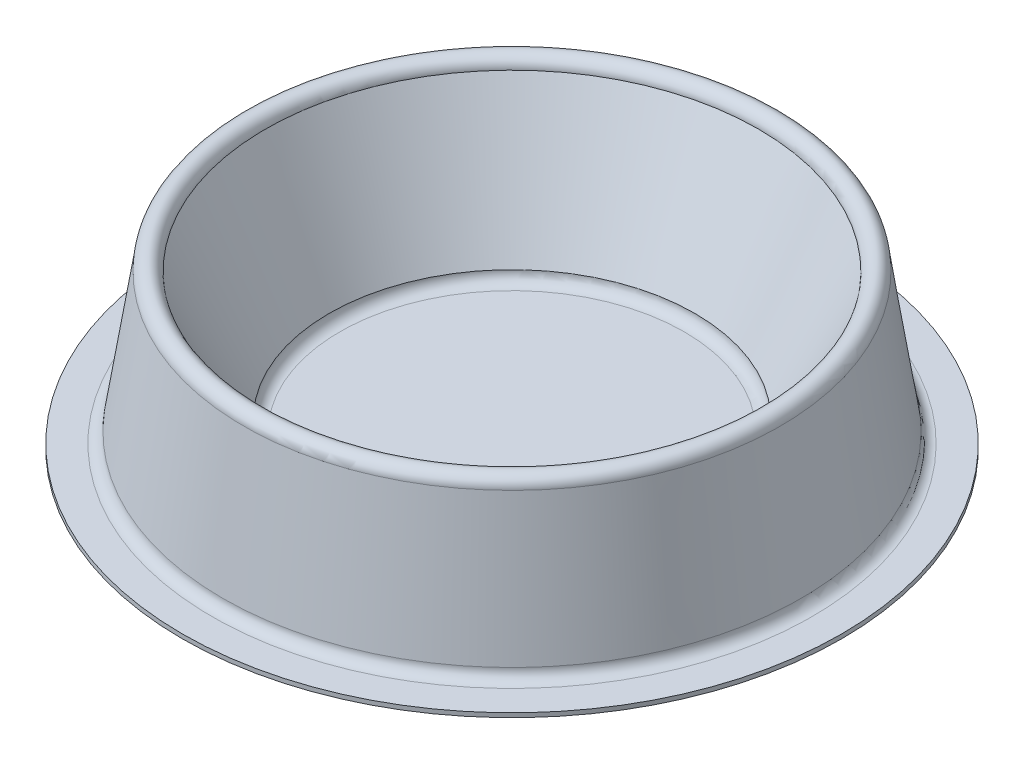
ISO-10303-21;
HEADER;
FILE_DESCRIPTION(('STEP AP214'),'2;1');
FILE_NAME('part.step','',(''),(''),'','','');
FILE_SCHEMA(('AUTOMOTIVE_DESIGN { 1 0 10303 214 1 1 1 1 }'));
ENDSEC;
DATA;
#1=APPLICATION_CONTEXT('core data for automotive mechanical design processes');
#2=APPLICATION_PROTOCOL_DEFINITION('international standard','automotive_design',2000,#1);
#3=PRODUCT_CONTEXT('',#1,'mechanical');
#4=PRODUCT('Part','Part','',(#3));
#5=PRODUCT_RELATED_PRODUCT_CATEGORY('part','',(#4));
#6=PRODUCT_DEFINITION_FORMATION('','',#4);
#7=PRODUCT_DEFINITION_CONTEXT('part definition',#1,'design');
#8=PRODUCT_DEFINITION('design','',#6,#7);
#9=PRODUCT_DEFINITION_SHAPE('','',#8);
#10=(LENGTH_UNIT() NAMED_UNIT(*) SI_UNIT(.MILLI.,.METRE.));
#11=(NAMED_UNIT(*) PLANE_ANGLE_UNIT() SI_UNIT($,.RADIAN.));
#12=(NAMED_UNIT(*) SI_UNIT($,.STERADIAN.) SOLID_ANGLE_UNIT());
#13=UNCERTAINTY_MEASURE_WITH_UNIT(LENGTH_MEASURE(1.E-05),#10,'distance_accuracy_value','');
#14=(GEOMETRIC_REPRESENTATION_CONTEXT(3) GLOBAL_UNCERTAINTY_ASSIGNED_CONTEXT((#13)) GLOBAL_UNIT_ASSIGNED_CONTEXT((#10,
#11,#12)) REPRESENTATION_CONTEXT('',''));
#15=CARTESIAN_POINT('',(0.,0.,0.));
#16=DIRECTION('',(0.,0.,1.));
#17=DIRECTION('',(1.,0.,0.));
#18=AXIS2_PLACEMENT_3D('',#15,#16,#17);
#19=CARTESIAN_POINT('',(9.68105345448683,1.5,0.));
#20=DIRECTION('',(0.,1.,0.));
#21=DIRECTION('',(0.,0.,1.));
#22=AXIS2_PLACEMENT_3D('',#19,#20,#21);
#23=PLANE('',#22);
#24=CARTESIAN_POINT('',(50.1810534544868,1.5,0.));
#25=DIRECTION('',(0.,-1.,0.));
#26=DIRECTION('',(0.,0.,-1.));
#27=AXIS2_PLACEMENT_3D('',#24,#25,#26);
#28=CIRCLE('',#27,40.5);
#29=CARTESIAN_POINT('',(50.1810534544868,1.5,-40.5));
#30=VERTEX_POINT('',#29);
#31=EDGE_CURVE('E76',#30,#30,#28,.T.);
#32=ORIENTED_EDGE('',*,*,#31,.T.);
#33=EDGE_LOOP('',(#32));
#34=FACE_BOUND('',#33,.T.);
#35=ADVANCED_FACE('F30',(#34),#23,.F.);
#36=CARTESIAN_POINT('',(9.68105345448683,2.5,0.));
#37=DIRECTION('',(0.,1.,0.));
#38=DIRECTION('',(0.,0.,1.));
#39=AXIS2_PLACEMENT_3D('',#36,#37,#38);
#40=PLANE('',#39);
#41=CARTESIAN_POINT('',(50.1810534544868,2.5,0.));
#42=DIRECTION('',(0.,-1.,0.));
#43=DIRECTION('',(0.,0.,-1.));
#44=AXIS2_PLACEMENT_3D('',#41,#42,#43);
#45=CIRCLE('',#44,40.5);
#46=CARTESIAN_POINT('',(50.1810534544868,2.5,-40.5));
#47=VERTEX_POINT('',#46);
#48=EDGE_CURVE('E10',#47,#47,#45,.T.);
#49=ORIENTED_EDGE('',*,*,#48,.F.);
#50=EDGE_LOOP('',(#49));
#51=FACE_BOUND('',#50,.T.);
#52=ADVANCED_FACE('F129',(#51),#40,.T.);
#53=CARTESIAN_POINT('',(50.1810534544868,5.,0.));
#54=DIRECTION('',(0.,-1.,0.));
#55=DIRECTION('',(0.,0.,-1.));
#56=AXIS2_PLACEMENT_3D('',#53,#54,#55);
#57=TOROIDAL_SURFACE('',#56,40.5,2.5);
#58=ORIENTED_EDGE('',*,*,#48,.T.);
#59=EDGE_LOOP('',(#58));
#60=FACE_BOUND('',#59,.T.);
#61=CARTESIAN_POINT('',(50.1810534544868,5.,0.));
#62=DIRECTION('',(0.,-1.,0.));
#63=DIRECTION('',(0.,0.,-1.));
#64=AXIS2_PLACEMENT_3D('',#61,#62,#63);
#65=CIRCLE('',#64,43.);
#66=CARTESIAN_POINT('',(50.1810534544868,5.,-43.));
#67=VERTEX_POINT('',#66);
#68=EDGE_CURVE('E36',#67,#67,#65,.T.);
#69=ORIENTED_EDGE('',*,*,#68,.F.);
#70=EDGE_LOOP('',(#69));
#71=FACE_BOUND('',#70,.T.);
#72=ADVANCED_FACE('F133',(#60,#71),#57,.F.);
#73=CARTESIAN_POINT('',(50.1810534544868,35.,0.));
#74=DIRECTION('',(0.,1.,0.));
#75=DIRECTION('',(0.,0.,1.));
#76=AXIS2_PLACEMENT_3D('',#73,#74,#75);
#77=CONICAL_SURFACE('',#76,58.,0.463647609000806);
#78=ORIENTED_EDGE('',*,*,#68,.T.);
#79=EDGE_LOOP('',(#78));
#80=FACE_BOUND('',#79,.T.);
#81=CARTESIAN_POINT('',(50.1810534544868,35.,0.));
#82=DIRECTION('',(0.,-1.,0.));
#83=DIRECTION('',(0.,0.,-1.));
#84=AXIS2_PLACEMENT_3D('',#81,#82,#83);
#85=CIRCLE('',#84,58.);
#86=CARTESIAN_POINT('',(50.1810534544868,35.,-58.));
#87=VERTEX_POINT('',#86);
#88=EDGE_CURVE('E40',#87,#87,#85,.T.);
#89=ORIENTED_EDGE('',*,*,#88,.F.);
#90=EDGE_LOOP('',(#89));
#91=FACE_BOUND('',#90,.T.);
#92=ADVANCED_FACE('F138',(#80,#91),#77,.F.);
#93=CARTESIAN_POINT('',(50.1810534544868,35.,0.));
#94=DIRECTION('',(0.,-1.,0.));
#95=DIRECTION('',(0.,0.,-1.));
#96=AXIS2_PLACEMENT_3D('',#93,#94,#95);
#97=TOROIDAL_SURFACE('',#96,60.5,2.5);
#98=ORIENTED_EDGE('',*,*,#88,.T.);
#99=EDGE_LOOP('',(#98));
#100=FACE_BOUND('',#99,.T.);
#101=CARTESIAN_POINT('',(50.1810534544868,35.,0.));
#102=DIRECTION('',(0.,-1.,0.));
#103=DIRECTION('',(0.,0.,-1.));
#104=AXIS2_PLACEMENT_3D('',#101,#102,#103);
#105=CIRCLE('',#104,63.);
#106=CARTESIAN_POINT('',(50.1810534544868,35.,-63.));
#107=VERTEX_POINT('',#106);
#108=EDGE_CURVE('E44',#107,#107,#105,.T.);
#109=ORIENTED_EDGE('',*,*,#108,.F.);
#110=EDGE_LOOP('',(#109));
#111=FACE_BOUND('',#110,.T.);
#112=ADVANCED_FACE('F143',(#100,#111),#97,.T.);
#113=CARTESIAN_POINT('',(50.1810534544868,2.5,0.));
#114=DIRECTION('',(0.,-1.,0.));
#115=DIRECTION('',(0.,0.,-1.));
#116=AXIS2_PLACEMENT_3D('',#113,#114,#115);
#117=CONICAL_SURFACE('',#116,68.,0.152649328395265);
#118=ORIENTED_EDGE('',*,*,#108,.T.);
#119=EDGE_LOOP('',(#118));
#120=FACE_BOUND('',#119,.T.);
#121=CARTESIAN_POINT('',(50.1810534544868,2.5,0.));
#122=DIRECTION('',(0.,-1.,0.));
#123=DIRECTION('',(0.,0.,-1.));
#124=AXIS2_PLACEMENT_3D('',#121,#122,#123);
#125=CIRCLE('',#124,68.);
#126=CARTESIAN_POINT('',(50.1810534544868,2.5,-68.));
#127=VERTEX_POINT('',#126);
#128=EDGE_CURVE('E49',#127,#127,#125,.T.);
#129=ORIENTED_EDGE('',*,*,#128,.F.);
#130=EDGE_LOOP('',(#129));
#131=FACE_BOUND('',#130,.T.);
#132=ADVANCED_FACE('F146',(#120,#131),#117,.T.);
#133=CARTESIAN_POINT('',(50.1810534544868,2.5,0.));
#134=DIRECTION('',(0.,-1.,0.));
#135=DIRECTION('',(0.,0.,-1.));
#136=AXIS2_PLACEMENT_3D('',#133,#134,#135);
#137=TOROIDAL_SURFACE('',#136,70.5,2.5);
#138=ORIENTED_EDGE('',*,*,#128,.T.);
#139=EDGE_LOOP('',(#138));
#140=FACE_BOUND('',#139,.T.);
#141=CARTESIAN_POINT('',(50.1810534544868,0.,0.));
#142=DIRECTION('',(0.,-1.,0.));
#143=DIRECTION('',(0.,0.,-1.));
#144=AXIS2_PLACEMENT_3D('',#141,#142,#143);
#145=CIRCLE('',#144,70.5);
#146=CARTESIAN_POINT('',(50.1810534544868,0.,-70.5));
#147=VERTEX_POINT('',#146);
#148=EDGE_CURVE('E52',#147,#147,#145,.T.);
#149=ORIENTED_EDGE('',*,*,#148,.F.);
#150=EDGE_LOOP('',(#149));
#151=FACE_BOUND('',#150,.T.);
#152=ADVANCED_FACE('F125',(#140,#151),#137,.F.);
#153=CARTESIAN_POINT('',(-27.3189465455132,0.,0.));
#154=DIRECTION('',(0.,1.,0.));
#155=DIRECTION('',(0.,0.,1.));
#156=AXIS2_PLACEMENT_3D('',#153,#154,#155);
#157=PLANE('',#156);
#158=ORIENTED_EDGE('',*,*,#148,.T.);
#159=EDGE_LOOP('',(#158));
#160=FACE_BOUND('',#159,.T.);
#161=CARTESIAN_POINT('',(50.1810534544868,0.,0.));
#162=DIRECTION('',(0.,-1.,0.));
#163=DIRECTION('',(0.,0.,-1.));
#164=AXIS2_PLACEMENT_3D('',#161,#162,#163);
#165=CIRCLE('',#164,77.5);
#166=CARTESIAN_POINT('',(50.1810534544868,0.,-77.5));
#167=VERTEX_POINT('',#166);
#168=EDGE_CURVE('E55',#167,#167,#165,.T.);
#169=ORIENTED_EDGE('',*,*,#168,.F.);
#170=EDGE_LOOP('',(#169));
#171=FACE_BOUND('',#170,.T.);
#172=ADVANCED_FACE('F119',(#160,#171),#157,.T.);
#173=CARTESIAN_POINT('',(50.1810534544868,2.5,0.));
#174=DIRECTION('',(0.,-1.,0.));
#175=DIRECTION('',(0.,0.,-1.));
#176=AXIS2_PLACEMENT_3D('',#173,#174,#175);
#177=CYLINDRICAL_SURFACE('',#176,77.5);
#178=ORIENTED_EDGE('',*,*,#168,.T.);
#179=EDGE_LOOP('',(#178));
#180=FACE_BOUND('',#179,.T.);
#181=CARTESIAN_POINT('',(50.1810534544868,-1.,0.));
#182=DIRECTION('',(0.,-1.,0.));
#183=DIRECTION('',(0.,0.,-1.));
#184=AXIS2_PLACEMENT_3D('',#181,#182,#183);
#185=CIRCLE('',#184,77.5);
#186=CARTESIAN_POINT('',(50.1810534544868,-1.,-77.5));
#187=VERTEX_POINT('',#186);
#188=EDGE_CURVE('E58',#187,#187,#185,.T.);
#189=ORIENTED_EDGE('',*,*,#188,.F.);
#190=EDGE_LOOP('',(#189));
#191=FACE_BOUND('',#190,.T.);
#192=ADVANCED_FACE('F114',(#180,#191),#177,.T.);
#193=CARTESIAN_POINT('',(-27.3189465455132,-1.,0.));
#194=DIRECTION('',(0.,1.,0.));
#195=DIRECTION('',(0.,0.,1.));
#196=AXIS2_PLACEMENT_3D('',#193,#194,#195);
#197=PLANE('',#196);
#198=CARTESIAN_POINT('',(50.1810534544868,-1.,0.));
#199=DIRECTION('',(0.,-1.,0.));
#200=DIRECTION('',(0.,0.,-1.));
#201=AXIS2_PLACEMENT_3D('',#198,#199,#200);
#202=CIRCLE('',#201,70.5);
#203=CARTESIAN_POINT('',(50.1810534544868,-1.,-70.5));
#204=VERTEX_POINT('',#203);
#205=EDGE_CURVE('E61',#204,#204,#202,.T.);
#206=ORIENTED_EDGE('',*,*,#205,.F.);
#207=EDGE_LOOP('',(#206));
#208=FACE_BOUND('',#207,.T.);
#209=ORIENTED_EDGE('',*,*,#188,.T.);
#210=EDGE_LOOP('',(#209));
#211=FACE_BOUND('',#210,.T.);
#212=ADVANCED_FACE('F108',(#208,#211),#197,.F.);
#213=CARTESIAN_POINT('',(50.1810534544868,2.5,0.));
#214=DIRECTION('',(0.,-1.,0.));
#215=DIRECTION('',(0.,0.,-1.));
#216=AXIS2_PLACEMENT_3D('',#213,#214,#215);
#217=TOROIDAL_SURFACE('',#216,70.5,3.5);
#218=CARTESIAN_POINT('',(50.1810534544868,2.41715243454848,0.));
#219=DIRECTION('',(0.,-1.,0.));
#220=DIRECTION('',(0.,0.,-1.));
#221=AXIS2_PLACEMENT_3D('',#218,#219,#220);
#222=CIRCLE('',#221,67.0009806686875);
#223=CARTESIAN_POINT('',(50.1810534544868,2.41715243454848,-67.0009806686875));
#224=VERTEX_POINT('',#223);
#225=EDGE_CURVE('E64',#224,#224,#222,.T.);
#226=ORIENTED_EDGE('',*,*,#225,.F.);
#227=EDGE_LOOP('',(#226));
#228=FACE_BOUND('',#227,.T.);
#229=ORIENTED_EDGE('',*,*,#205,.T.);
#230=EDGE_LOOP('',(#229));
#231=FACE_BOUND('',#230,.T.);
#232=ADVANCED_FACE('F102',(#228,#231),#217,.T.);
#233=CARTESIAN_POINT('',(50.1810534544868,2.41715243454848,0.));
#234=DIRECTION('',(0.,-1.,0.));
#235=DIRECTION('',(0.,0.,-1.));
#236=AXIS2_PLACEMENT_3D('',#233,#234,#235);
#237=CONICAL_SURFACE('',#236,67.0009806686875,0.152649328395265);
#238=CARTESIAN_POINT('',(50.1810534544868,34.9331998185491,0.));
#239=DIRECTION('',(0.,-1.,0.));
#240=DIRECTION('',(0.,0.,-1.));
#241=AXIS2_PLACEMENT_3D('',#238,#239,#240);
#242=CIRCLE('',#241,61.9985118403797);
#243=CARTESIAN_POINT('',(50.1810534544868,34.9331998185491,-61.9985118403797));
#244=VERTEX_POINT('',#243);
#245=EDGE_CURVE('E67',#244,#244,#242,.T.);
#246=ORIENTED_EDGE('',*,*,#245,.F.);
#247=EDGE_LOOP('',(#246));
#248=FACE_BOUND('',#247,.T.);
#249=ORIENTED_EDGE('',*,*,#225,.T.);
#250=EDGE_LOOP('',(#249));
#251=FACE_BOUND('',#250,.T.);
#252=ADVANCED_FACE('F96',(#248,#251),#237,.F.);
#253=CARTESIAN_POINT('',(50.1810534544868,35.,0.));
#254=DIRECTION('',(0.,-1.,0.));
#255=DIRECTION('',(0.,0.,-1.));
#256=AXIS2_PLACEMENT_3D('',#253,#254,#255);
#257=TOROIDAL_SURFACE('',#256,60.5,1.5);
#258=CARTESIAN_POINT('',(50.1810534544868,34.7927148526053,0.));
#259=DIRECTION('',(0.,-1.,0.));
#260=DIRECTION('',(0.,0.,-1.));
#261=AXIS2_PLACEMENT_3D('',#258,#259,#260);
#262=CIRCLE('',#261,59.0143914150526);
#263=CARTESIAN_POINT('',(50.1810534544868,34.7927148526053,-59.0143914150526));
#264=VERTEX_POINT('',#263);
#265=EDGE_CURVE('E70',#264,#264,#262,.T.);
#266=ORIENTED_EDGE('',*,*,#265,.F.);
#267=EDGE_LOOP('',(#266));
#268=FACE_BOUND('',#267,.T.);
#269=ORIENTED_EDGE('',*,*,#245,.T.);
#270=EDGE_LOOP('',(#269));
#271=FACE_BOUND('',#270,.T.);
#272=ADVANCED_FACE('F90',(#268,#271),#257,.F.);
#273=CARTESIAN_POINT('',(50.1810534544868,34.7927148526053,0.));
#274=DIRECTION('',(0.,1.,0.));
#275=DIRECTION('',(0.,0.,1.));
#276=AXIS2_PLACEMENT_3D('',#273,#274,#275);
#277=CONICAL_SURFACE('',#276,59.0143914150526,0.463647609000806);
#278=CARTESIAN_POINT('',(50.1810534544868,4.74538492705503,0.));
#279=DIRECTION('',(0.,-1.,0.));
#280=DIRECTION('',(0.,0.,-1.));
#281=AXIS2_PLACEMENT_3D('',#278,#279,#280);
#282=CIRCLE('',#281,43.9907264522774);
#283=CARTESIAN_POINT('',(50.1810534544868,4.74538492705503,-43.9907264522774));
#284=VERTEX_POINT('',#283);
#285=EDGE_CURVE('E73',#284,#284,#282,.T.);
#286=ORIENTED_EDGE('',*,*,#285,.F.);
#287=EDGE_LOOP('',(#286));
#288=FACE_BOUND('',#287,.T.);
#289=ORIENTED_EDGE('',*,*,#265,.T.);
#290=EDGE_LOOP('',(#289));
#291=FACE_BOUND('',#290,.T.);
#292=ADVANCED_FACE('F84',(#288,#291),#277,.T.);
#293=CARTESIAN_POINT('',(50.1810534544868,5.,0.));
#294=DIRECTION('',(0.,-1.,0.));
#295=DIRECTION('',(0.,0.,-1.));
#296=AXIS2_PLACEMENT_3D('',#293,#294,#295);
#297=TOROIDAL_SURFACE('',#296,40.5,3.5);
#298=ORIENTED_EDGE('',*,*,#31,.F.);
#299=EDGE_LOOP('',(#298));
#300=FACE_BOUND('',#299,.T.);
#301=ORIENTED_EDGE('',*,*,#285,.T.);
#302=EDGE_LOOP('',(#301));
#303=FACE_BOUND('',#302,.T.);
#304=ADVANCED_FACE('F81',(#300,#303),#297,.T.);
#305=CLOSED_SHELL('',(#35,#52,#72,#92,#112,#132,#152,#172,#192,#212,#232,#252,#272,#292,#304));
#306=MANIFOLD_SOLID_BREP('B2',#305);
#307=ADVANCED_BREP_SHAPE_REPRESENTATION('',(#18,#306),#14);
#308=SHAPE_DEFINITION_REPRESENTATION(#9,#307);
ENDSEC;
END-ISO-10303-21;
